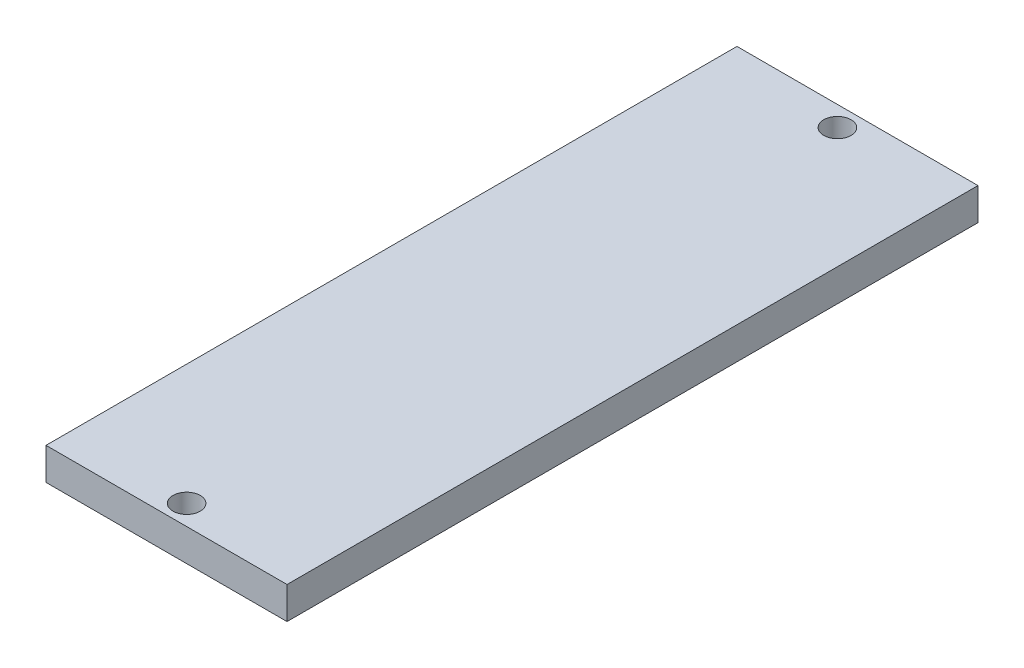
ISO-10303-21;
HEADER;
FILE_DESCRIPTION(('STEP AP214'),'2;1');
FILE_NAME('part.step','',(''),(''),'','','');
FILE_SCHEMA(('AUTOMOTIVE_DESIGN { 1 0 10303 214 1 1 1 1 }'));
ENDSEC;
DATA;
#1=APPLICATION_CONTEXT('core data for automotive mechanical design processes');
#2=APPLICATION_PROTOCOL_DEFINITION('international standard','automotive_design',2000,#1);
#3=PRODUCT_CONTEXT('',#1,'mechanical');
#4=PRODUCT('Part','Part','',(#3));
#5=PRODUCT_RELATED_PRODUCT_CATEGORY('part','',(#4));
#6=PRODUCT_DEFINITION_FORMATION('','',#4);
#7=PRODUCT_DEFINITION_CONTEXT('part definition',#1,'design');
#8=PRODUCT_DEFINITION('design','',#6,#7);
#9=PRODUCT_DEFINITION_SHAPE('','',#8);
#10=(LENGTH_UNIT() NAMED_UNIT(*) SI_UNIT(.MILLI.,.METRE.));
#11=(NAMED_UNIT(*) PLANE_ANGLE_UNIT() SI_UNIT($,.RADIAN.));
#12=(NAMED_UNIT(*) SI_UNIT($,.STERADIAN.) SOLID_ANGLE_UNIT());
#13=UNCERTAINTY_MEASURE_WITH_UNIT(LENGTH_MEASURE(1.E-05),#10,'distance_accuracy_value','');
#14=(GEOMETRIC_REPRESENTATION_CONTEXT(3) GLOBAL_UNCERTAINTY_ASSIGNED_CONTEXT((#13)) GLOBAL_UNIT_ASSIGNED_CONTEXT((#10,
#11,#12)) REPRESENTATION_CONTEXT('',''));
#15=CARTESIAN_POINT('',(0.,0.,0.));
#16=DIRECTION('',(0.,0.,1.));
#17=DIRECTION('',(1.,0.,0.));
#18=AXIS2_PLACEMENT_3D('',#15,#16,#17);
#19=CARTESIAN_POINT('',(0.,4.,0.));
#20=DIRECTION('',(0.,1.,0.));
#21=DIRECTION('',(0.,0.,1.));
#22=AXIS2_PLACEMENT_3D('',#19,#20,#21);
#23=PLANE('',#22);
#24=CARTESIAN_POINT('',(0.,4.,-40.5));
#25=DIRECTION('',(0.,1.,0.));
#26=DIRECTION('',(0.,0.,1.));
#27=AXIS2_PLACEMENT_3D('',#24,#25,#26);
#28=CIRCLE('',#27,1.7);
#29=CARTESIAN_POINT('',(0.,4.,-38.8));
#30=VERTEX_POINT('',#29);
#31=EDGE_CURVE('E104',#30,#30,#28,.T.);
#32=ORIENTED_EDGE('',*,*,#31,.F.);
#33=EDGE_LOOP('',(#32));
#34=FACE_BOUND('',#33,.T.);
#35=DIRECTION('',(0.,0.,-1.));
#36=VECTOR('',#35,1.);
#37=CARTESIAN_POINT('',(15.,4.,-43.));
#38=LINE('',#37,#36);
#39=CARTESIAN_POINT('',(15.,4.,43.));
#40=VERTEX_POINT('',#39);
#41=CARTESIAN_POINT('',(15.,4.,-43.));
#42=VERTEX_POINT('',#41);
#43=EDGE_CURVE('E89',#40,#42,#38,.T.);
#44=ORIENTED_EDGE('',*,*,#43,.T.);
#45=DIRECTION('',(-1.,0.,0.));
#46=VECTOR('',#45,1.);
#47=CARTESIAN_POINT('',(-15.,4.,-43.));
#48=LINE('',#47,#46);
#49=CARTESIAN_POINT('',(-15.,4.,-43.));
#50=VERTEX_POINT('',#49);
#51=EDGE_CURVE('E84',#42,#50,#48,.T.);
#52=ORIENTED_EDGE('',*,*,#51,.T.);
#53=DIRECTION('',(0.,0.,1.));
#54=VECTOR('',#53,1.);
#55=CARTESIAN_POINT('',(-15.,4.,-43.));
#56=LINE('',#55,#54);
#57=CARTESIAN_POINT('',(-15.,4.,43.));
#58=VERTEX_POINT('',#57);
#59=EDGE_CURVE('E87',#50,#58,#56,.T.);
#60=ORIENTED_EDGE('',*,*,#59,.T.);
#61=DIRECTION('',(1.,0.,0.));
#62=VECTOR('',#61,1.);
#63=CARTESIAN_POINT('',(-15.,4.,43.));
#64=LINE('',#63,#62);
#65=EDGE_CURVE('E54',#58,#40,#64,.T.);
#66=ORIENTED_EDGE('',*,*,#65,.T.);
#67=EDGE_LOOP('',(#44,#52,#60,#66));
#68=FACE_BOUND('',#67,.T.);
#69=CARTESIAN_POINT('',(0.,4.,40.5));
#70=DIRECTION('',(0.,1.,0.));
#71=DIRECTION('',(0.,0.,1.));
#72=AXIS2_PLACEMENT_3D('',#69,#70,#71);
#73=CIRCLE('',#72,1.7);
#74=CARTESIAN_POINT('',(0.,4.,42.2));
#75=VERTEX_POINT('',#74);
#76=EDGE_CURVE('E119',#75,#75,#73,.T.);
#77=ORIENTED_EDGE('',*,*,#76,.F.);
#78=EDGE_LOOP('',(#77));
#79=FACE_BOUND('',#78,.T.);
#80=ADVANCED_FACE('F37',(#34,#68,#79),#23,.T.);
#81=CARTESIAN_POINT('',(0.,0.,0.));
#82=DIRECTION('',(0.,1.,0.));
#83=DIRECTION('',(0.,0.,1.));
#84=AXIS2_PLACEMENT_3D('',#81,#82,#83);
#85=PLANE('',#84);
#86=DIRECTION('',(0.,0.,-1.));
#87=VECTOR('',#86,1.);
#88=CARTESIAN_POINT('',(15.,0.,-43.));
#89=LINE('',#88,#87);
#90=CARTESIAN_POINT('',(15.,0.,43.));
#91=VERTEX_POINT('',#90);
#92=CARTESIAN_POINT('',(15.,0.,-43.));
#93=VERTEX_POINT('',#92);
#94=EDGE_CURVE('E101',#91,#93,#89,.T.);
#95=ORIENTED_EDGE('',*,*,#94,.F.);
#96=DIRECTION('',(1.,0.,0.));
#97=VECTOR('',#96,1.);
#98=CARTESIAN_POINT('',(-15.,0.,43.));
#99=LINE('',#98,#97);
#100=CARTESIAN_POINT('',(-15.,0.,43.));
#101=VERTEX_POINT('',#100);
#102=EDGE_CURVE('E77',#101,#91,#99,.T.);
#103=ORIENTED_EDGE('',*,*,#102,.F.);
#104=DIRECTION('',(0.,0.,1.));
#105=VECTOR('',#104,1.);
#106=CARTESIAN_POINT('',(-15.,0.,-43.));
#107=LINE('',#106,#105);
#108=CARTESIAN_POINT('',(-15.,0.,-43.));
#109=VERTEX_POINT('',#108);
#110=EDGE_CURVE('E71',#109,#101,#107,.T.);
#111=ORIENTED_EDGE('',*,*,#110,.F.);
#112=DIRECTION('',(-1.,0.,0.));
#113=VECTOR('',#112,1.);
#114=CARTESIAN_POINT('',(-15.,0.,-43.));
#115=LINE('',#114,#113);
#116=EDGE_CURVE('E93',#93,#109,#115,.T.);
#117=ORIENTED_EDGE('',*,*,#116,.F.);
#118=EDGE_LOOP('',(#95,#103,#111,#117));
#119=FACE_BOUND('',#118,.T.);
#120=CARTESIAN_POINT('',(0.,0.,-40.5));
#121=DIRECTION('',(0.,1.,0.));
#122=DIRECTION('',(0.,0.,1.));
#123=AXIS2_PLACEMENT_3D('',#120,#121,#122);
#124=CIRCLE('',#123,1.7);
#125=CARTESIAN_POINT('',(0.,0.,-38.8));
#126=VERTEX_POINT('',#125);
#127=EDGE_CURVE('E116',#126,#126,#124,.T.);
#128=ORIENTED_EDGE('',*,*,#127,.T.);
#129=EDGE_LOOP('',(#128));
#130=FACE_BOUND('',#129,.T.);
#131=CARTESIAN_POINT('',(0.,0.,40.5));
#132=DIRECTION('',(0.,1.,0.));
#133=DIRECTION('',(0.,0.,1.));
#134=AXIS2_PLACEMENT_3D('',#131,#132,#133);
#135=CIRCLE('',#134,1.7);
#136=CARTESIAN_POINT('',(0.,0.,42.2));
#137=VERTEX_POINT('',#136);
#138=EDGE_CURVE('E122',#137,#137,#135,.T.);
#139=ORIENTED_EDGE('',*,*,#138,.T.);
#140=EDGE_LOOP('',(#139));
#141=FACE_BOUND('',#140,.T.);
#142=ADVANCED_FACE('F112',(#119,#130,#141),#85,.F.);
#143=CARTESIAN_POINT('',(15.,4.,-43.));
#144=DIRECTION('',(-1.,0.,0.));
#145=DIRECTION('',(0.,0.,1.));
#146=AXIS2_PLACEMENT_3D('',#143,#144,#145);
#147=PLANE('',#146);
#148=ORIENTED_EDGE('',*,*,#94,.T.);
#149=DIRECTION('',(0.,-1.,0.));
#150=VECTOR('',#149,1.);
#151=CARTESIAN_POINT('',(15.,4.,-43.));
#152=LINE('',#151,#150);
#153=EDGE_CURVE('E11',#42,#93,#152,.T.);
#154=ORIENTED_EDGE('',*,*,#153,.F.);
#155=ORIENTED_EDGE('',*,*,#43,.F.);
#156=DIRECTION('',(0.,-1.,0.));
#157=VECTOR('',#156,1.);
#158=CARTESIAN_POINT('',(15.,4.,43.));
#159=LINE('',#158,#157);
#160=EDGE_CURVE('E97',#40,#91,#159,.T.);
#161=ORIENTED_EDGE('',*,*,#160,.T.);
#162=EDGE_LOOP('',(#148,#154,#155,#161));
#163=FACE_BOUND('',#162,.T.);
#164=ADVANCED_FACE('F39',(#163),#147,.F.);
#165=CARTESIAN_POINT('',(-15.,4.,-43.));
#166=DIRECTION('',(0.,0.,1.));
#167=DIRECTION('',(1.,0.,0.));
#168=AXIS2_PLACEMENT_3D('',#165,#166,#167);
#169=PLANE('',#168);
#170=ORIENTED_EDGE('',*,*,#116,.T.);
#171=DIRECTION('',(0.,-1.,0.));
#172=VECTOR('',#171,1.);
#173=CARTESIAN_POINT('',(-15.,4.,-43.));
#174=LINE('',#173,#172);
#175=EDGE_CURVE('E46',#50,#109,#174,.T.);
#176=ORIENTED_EDGE('',*,*,#175,.F.);
#177=ORIENTED_EDGE('',*,*,#51,.F.);
#178=ORIENTED_EDGE('',*,*,#153,.T.);
#179=EDGE_LOOP('',(#170,#176,#177,#178));
#180=FACE_BOUND('',#179,.T.);
#181=ADVANCED_FACE('F92',(#180),#169,.F.);
#182=CARTESIAN_POINT('',(-15.,4.,-43.));
#183=DIRECTION('',(1.,0.,0.));
#184=DIRECTION('',(0.,0.,-1.));
#185=AXIS2_PLACEMENT_3D('',#182,#183,#184);
#186=PLANE('',#185);
#187=ORIENTED_EDGE('',*,*,#110,.T.);
#188=DIRECTION('',(0.,-1.,0.));
#189=VECTOR('',#188,1.);
#190=CARTESIAN_POINT('',(-15.,4.,43.));
#191=LINE('',#190,#189);
#192=EDGE_CURVE('E94',#58,#101,#191,.T.);
#193=ORIENTED_EDGE('',*,*,#192,.F.);
#194=ORIENTED_EDGE('',*,*,#59,.F.);
#195=ORIENTED_EDGE('',*,*,#175,.T.);
#196=EDGE_LOOP('',(#187,#193,#194,#195));
#197=FACE_BOUND('',#196,.T.);
#198=ADVANCED_FACE('F95',(#197),#186,.F.);
#199=CARTESIAN_POINT('',(-15.,4.,43.));
#200=DIRECTION('',(0.,0.,-1.));
#201=DIRECTION('',(-1.,0.,0.));
#202=AXIS2_PLACEMENT_3D('',#199,#200,#201);
#203=PLANE('',#202);
#204=ORIENTED_EDGE('',*,*,#102,.T.);
#205=ORIENTED_EDGE('',*,*,#160,.F.);
#206=ORIENTED_EDGE('',*,*,#65,.F.);
#207=ORIENTED_EDGE('',*,*,#192,.T.);
#208=EDGE_LOOP('',(#204,#205,#206,#207));
#209=FACE_BOUND('',#208,.T.);
#210=ADVANCED_FACE('F109',(#209),#203,.F.);
#211=CARTESIAN_POINT('',(0.,4.,-40.5));
#212=DIRECTION('',(0.,-1.,0.));
#213=DIRECTION('',(0.,0.,-1.));
#214=AXIS2_PLACEMENT_3D('',#211,#212,#213);
#215=CYLINDRICAL_SURFACE('',#214,1.7);
#216=ORIENTED_EDGE('',*,*,#31,.T.);
#217=EDGE_LOOP('',(#216));
#218=FACE_BOUND('',#217,.T.);
#219=ORIENTED_EDGE('',*,*,#127,.F.);
#220=EDGE_LOOP('',(#219));
#221=FACE_BOUND('',#220,.T.);
#222=ADVANCED_FACE('F139',(#218,#221),#215,.F.);
#223=CARTESIAN_POINT('',(0.,4.,40.5));
#224=DIRECTION('',(0.,-1.,0.));
#225=DIRECTION('',(0.,0.,-1.));
#226=AXIS2_PLACEMENT_3D('',#223,#224,#225);
#227=CYLINDRICAL_SURFACE('',#226,1.7);
#228=ORIENTED_EDGE('',*,*,#76,.T.);
#229=EDGE_LOOP('',(#228));
#230=FACE_BOUND('',#229,.T.);
#231=ORIENTED_EDGE('',*,*,#138,.F.);
#232=EDGE_LOOP('',(#231));
#233=FACE_BOUND('',#232,.T.);
#234=ADVANCED_FACE('F128',(#230,#233),#227,.F.);
#235=CLOSED_SHELL('',(#80,#142,#164,#181,#198,#210,#222,#234));
#236=MANIFOLD_SOLID_BREP('B2',#235);
#237=ADVANCED_BREP_SHAPE_REPRESENTATION('',(#18,#236),#14);
#238=SHAPE_DEFINITION_REPRESENTATION(#9,#237);
ENDSEC;
END-ISO-10303-21;
